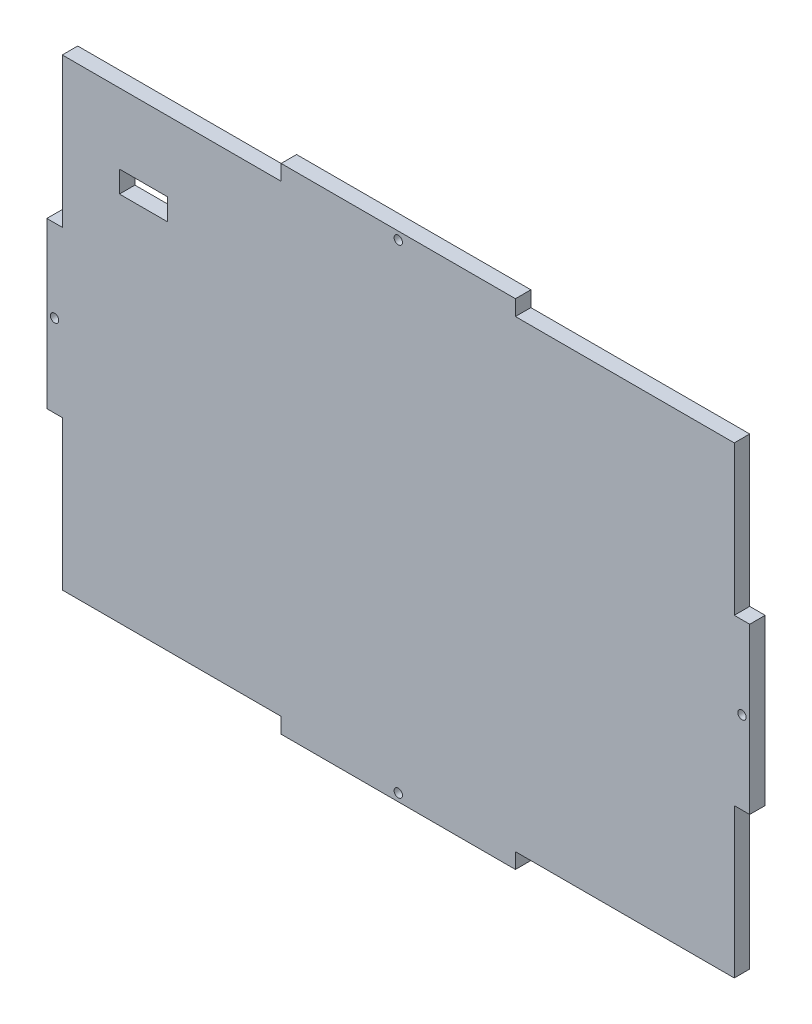
ISO-10303-21;
HEADER;
FILE_DESCRIPTION(('STEP AP214'),'2;1');
FILE_NAME('part.step','',(''),(''),'','','');
FILE_SCHEMA(('AUTOMOTIVE_DESIGN { 1 0 10303 214 1 1 1 1 }'));
ENDSEC;
DATA;
#1=APPLICATION_CONTEXT('core data for automotive mechanical design processes');
#2=APPLICATION_PROTOCOL_DEFINITION('international standard','automotive_design',2000,#1);
#3=PRODUCT_CONTEXT('',#1,'mechanical');
#4=PRODUCT('Part','Part','',(#3));
#5=PRODUCT_RELATED_PRODUCT_CATEGORY('part','',(#4));
#6=PRODUCT_DEFINITION_FORMATION('','',#4);
#7=PRODUCT_DEFINITION_CONTEXT('part definition',#1,'design');
#8=PRODUCT_DEFINITION('design','',#6,#7);
#9=PRODUCT_DEFINITION_SHAPE('','',#8);
#10=(LENGTH_UNIT() NAMED_UNIT(*) SI_UNIT(.MILLI.,.METRE.));
#11=(NAMED_UNIT(*) PLANE_ANGLE_UNIT() SI_UNIT($,.RADIAN.));
#12=(NAMED_UNIT(*) SI_UNIT($,.STERADIAN.) SOLID_ANGLE_UNIT());
#13=UNCERTAINTY_MEASURE_WITH_UNIT(LENGTH_MEASURE(1.E-05),#10,'distance_accuracy_value','');
#14=(GEOMETRIC_REPRESENTATION_CONTEXT(3) GLOBAL_UNCERTAINTY_ASSIGNED_CONTEXT((#13)) GLOBAL_UNIT_ASSIGNED_CONTEXT((#10,
#11,#12)) REPRESENTATION_CONTEXT('',''));
#15=CARTESIAN_POINT('',(0.,0.,0.));
#16=DIRECTION('',(0.,0.,1.));
#17=DIRECTION('',(1.,0.,0.));
#18=AXIS2_PLACEMENT_3D('',#15,#16,#17);
#19=CARTESIAN_POINT('',(115.57,-81.28,5.08));
#20=DIRECTION('',(-1.,0.,0.));
#21=DIRECTION('',(0.,0.,1.));
#22=AXIS2_PLACEMENT_3D('',#19,#20,#21);
#23=PLANE('',#22);
#24=DIRECTION('',(0.,0.,1.));
#25=VECTOR('',#24,1.);
#26=CARTESIAN_POINT('',(115.57,27.0933333333333,0.));
#27=LINE('',#26,#25);
#28=CARTESIAN_POINT('',(115.57,27.0933333333333,0.));
#29=VERTEX_POINT('',#28);
#30=CARTESIAN_POINT('',(115.57,27.0933333333333,5.07999999999999));
#31=VERTEX_POINT('',#30);
#32=EDGE_CURVE('E313',#29,#31,#27,.T.);
#33=ORIENTED_EDGE('',*,*,#32,.T.);
#34=DIRECTION('',(0.,1.,0.));
#35=VECTOR('',#34,1.);
#36=CARTESIAN_POINT('',(115.57,-81.28,5.08));
#37=LINE('',#36,#35);
#38=CARTESIAN_POINT('',(115.57,-27.0933333333333,5.07999999999999));
#39=VERTEX_POINT('',#38);
#40=EDGE_CURVE('E382',#39,#31,#37,.T.);
#41=ORIENTED_EDGE('',*,*,#40,.F.);
#42=DIRECTION('',(0.,0.,-1.));
#43=VECTOR('',#42,1.);
#44=CARTESIAN_POINT('',(115.57,-27.0933333333333,0.));
#45=LINE('',#44,#43);
#46=CARTESIAN_POINT('',(115.57,-27.0933333333333,0.));
#47=VERTEX_POINT('',#46);
#48=EDGE_CURVE('E318',#39,#47,#45,.T.);
#49=ORIENTED_EDGE('',*,*,#48,.T.);
#50=DIRECTION('',(0.,1.,0.));
#51=VECTOR('',#50,1.);
#52=CARTESIAN_POINT('',(115.57,-81.28,0.));
#53=LINE('',#52,#51);
#54=EDGE_CURVE('E379',#47,#29,#53,.T.);
#55=ORIENTED_EDGE('',*,*,#54,.T.);
#56=EDGE_LOOP('',(#33,#41,#49,#55));
#57=FACE_BOUND('',#56,.T.);
#58=ADVANCED_FACE('F33',(#57),#23,.F.);
#59=CARTESIAN_POINT('',(-115.57,81.28,5.08));
#60=DIRECTION('',(0.,-1.,0.));
#61=DIRECTION('',(0.,0.,-1.));
#62=AXIS2_PLACEMENT_3D('',#59,#60,#61);
#63=PLANE('',#62);
#64=DIRECTION('',(0.,0.,1.));
#65=VECTOR('',#64,1.);
#66=CARTESIAN_POINT('',(-38.5233333333334,81.28,0.));
#67=LINE('',#66,#65);
#68=CARTESIAN_POINT('',(-38.5233333333334,81.28,0.));
#69=VERTEX_POINT('',#68);
#70=CARTESIAN_POINT('',(-38.5233333333334,81.28,5.07999999999998));
#71=VERTEX_POINT('',#70);
#72=EDGE_CURVE('E258',#69,#71,#67,.T.);
#73=ORIENTED_EDGE('',*,*,#72,.T.);
#74=DIRECTION('',(-1.,0.,0.));
#75=VECTOR('',#74,1.);
#76=CARTESIAN_POINT('',(-115.57,81.28,5.08));
#77=LINE('',#76,#75);
#78=CARTESIAN_POINT('',(38.5233333333333,81.28,5.07999999999998));
#79=VERTEX_POINT('',#78);
#80=EDGE_CURVE('E384',#79,#71,#77,.T.);
#81=ORIENTED_EDGE('',*,*,#80,.F.);
#82=DIRECTION('',(0.,0.,-1.));
#83=VECTOR('',#82,1.);
#84=CARTESIAN_POINT('',(38.5233333333333,81.28,0.));
#85=LINE('',#84,#83);
#86=CARTESIAN_POINT('',(38.5233333333333,81.28,0.));
#87=VERTEX_POINT('',#86);
#88=EDGE_CURVE('E263',#79,#87,#85,.T.);
#89=ORIENTED_EDGE('',*,*,#88,.T.);
#90=DIRECTION('',(-1.,0.,0.));
#91=VECTOR('',#90,1.);
#92=CARTESIAN_POINT('',(-115.57,81.28,0.));
#93=LINE('',#92,#91);
#94=EDGE_CURVE('E389',#87,#69,#93,.T.);
#95=ORIENTED_EDGE('',*,*,#94,.T.);
#96=EDGE_LOOP('',(#73,#81,#89,#95));
#97=FACE_BOUND('',#96,.T.);
#98=ADVANCED_FACE('F455',(#97),#63,.F.);
#99=CARTESIAN_POINT('',(-115.57,-81.28,5.08));
#100=DIRECTION('',(1.,0.,0.));
#101=DIRECTION('',(0.,0.,-1.));
#102=AXIS2_PLACEMENT_3D('',#99,#100,#101);
#103=PLANE('',#102);
#104=DIRECTION('',(0.,0.,1.));
#105=VECTOR('',#104,1.);
#106=CARTESIAN_POINT('',(-115.57,-27.0933333333333,0.));
#107=LINE('',#106,#105);
#108=CARTESIAN_POINT('',(-115.57,-27.0933333333333,0.));
#109=VERTEX_POINT('',#108);
#110=CARTESIAN_POINT('',(-115.57,-27.0933333333333,5.07999999999999));
#111=VERTEX_POINT('',#110);
#112=EDGE_CURVE('E227',#109,#111,#107,.T.);
#113=ORIENTED_EDGE('',*,*,#112,.T.);
#114=DIRECTION('',(0.,-1.,0.));
#115=VECTOR('',#114,1.);
#116=CARTESIAN_POINT('',(-115.57,-81.28,5.08));
#117=LINE('',#116,#115);
#118=CARTESIAN_POINT('',(-115.57,27.0933333333333,5.07999999999999));
#119=VERTEX_POINT('',#118);
#120=EDGE_CURVE('E41',#119,#111,#117,.T.);
#121=ORIENTED_EDGE('',*,*,#120,.F.);
#122=DIRECTION('',(0.,0.,-1.));
#123=VECTOR('',#122,1.);
#124=CARTESIAN_POINT('',(-115.57,27.0933333333333,0.));
#125=LINE('',#124,#123);
#126=CARTESIAN_POINT('',(-115.57,27.0933333333333,0.));
#127=VERTEX_POINT('',#126);
#128=EDGE_CURVE('E235',#119,#127,#125,.T.);
#129=ORIENTED_EDGE('',*,*,#128,.T.);
#130=DIRECTION('',(0.,-1.,0.));
#131=VECTOR('',#130,1.);
#132=CARTESIAN_POINT('',(-115.57,-81.28,0.));
#133=LINE('',#132,#131);
#134=EDGE_CURVE('E391',#127,#109,#133,.T.);
#135=ORIENTED_EDGE('',*,*,#134,.T.);
#136=EDGE_LOOP('',(#113,#121,#129,#135));
#137=FACE_BOUND('',#136,.T.);
#138=ADVANCED_FACE('F434',(#137),#103,.F.);
#139=CARTESIAN_POINT('',(-115.57,-81.28,5.08));
#140=DIRECTION('',(0.,1.,0.));
#141=DIRECTION('',(0.,0.,1.));
#142=AXIS2_PLACEMENT_3D('',#139,#140,#141);
#143=PLANE('',#142);
#144=DIRECTION('',(0.,0.,1.));
#145=VECTOR('',#144,1.);
#146=CARTESIAN_POINT('',(-38.5233333333334,-81.28,0.));
#147=LINE('',#146,#145);
#148=CARTESIAN_POINT('',(-38.5233333333334,-81.28,0.));
#149=VERTEX_POINT('',#148);
#150=CARTESIAN_POINT('',(-38.5233333333334,-81.28,5.07999999999998));
#151=VERTEX_POINT('',#150);
#152=EDGE_CURVE('E287',#149,#151,#147,.T.);
#153=ORIENTED_EDGE('',*,*,#152,.F.);
#154=DIRECTION('',(1.,0.,0.));
#155=VECTOR('',#154,1.);
#156=CARTESIAN_POINT('',(-115.57,-81.28,0.));
#157=LINE('',#156,#155);
#158=CARTESIAN_POINT('',(38.5233333333333,-81.28,0.));
#159=VERTEX_POINT('',#158);
#160=EDGE_CURVE('E36',#149,#159,#157,.T.);
#161=ORIENTED_EDGE('',*,*,#160,.T.);
#162=DIRECTION('',(0.,0.,-1.));
#163=VECTOR('',#162,1.);
#164=CARTESIAN_POINT('',(38.5233333333333,-81.28,0.));
#165=LINE('',#164,#163);
#166=CARTESIAN_POINT('',(38.5233333333333,-81.28,5.07999999999998));
#167=VERTEX_POINT('',#166);
#168=EDGE_CURVE('E289',#167,#159,#165,.T.);
#169=ORIENTED_EDGE('',*,*,#168,.F.);
#170=DIRECTION('',(1.,0.,0.));
#171=VECTOR('',#170,1.);
#172=CARTESIAN_POINT('',(-115.57,-81.28,5.08));
#173=LINE('',#172,#171);
#174=EDGE_CURVE('E11',#151,#167,#173,.T.);
#175=ORIENTED_EDGE('',*,*,#174,.F.);
#176=EDGE_LOOP('',(#153,#161,#169,#175));
#177=FACE_BOUND('',#176,.T.);
#178=ADVANCED_FACE('F400',(#177),#143,.F.);
#179=CARTESIAN_POINT('',(0.,0.,0.));
#180=DIRECTION('',(0.,0.,-1.));
#181=DIRECTION('',(-1.,0.,0.));
#182=AXIS2_PLACEMENT_3D('',#179,#180,#181);
#183=PLANE('',#182);
#184=DIRECTION('',(0.,-1.,0.));
#185=VECTOR('',#184,1.);
#186=CARTESIAN_POINT('',(-75.946,53.086,0.));
#187=LINE('',#186,#185);
#188=CARTESIAN_POINT('',(-75.946,53.086,0.));
#189=VERTEX_POINT('',#188);
#190=CARTESIAN_POINT('',(-75.946,45.974,0.));
#191=VERTEX_POINT('',#190);
#192=EDGE_CURVE('E49',#189,#191,#187,.T.);
#193=ORIENTED_EDGE('',*,*,#192,.F.);
#194=DIRECTION('',(1.,0.,0.));
#195=VECTOR('',#194,1.);
#196=CARTESIAN_POINT('',(-75.946,53.086,0.));
#197=LINE('',#196,#195);
#198=CARTESIAN_POINT('',(-91.694,53.086,0.));
#199=VERTEX_POINT('',#198);
#200=EDGE_CURVE('E212',#199,#189,#197,.T.);
#201=ORIENTED_EDGE('',*,*,#200,.F.);
#202=DIRECTION('',(0.,1.,0.));
#203=VECTOR('',#202,1.);
#204=CARTESIAN_POINT('',(-91.694,53.086,0.));
#205=LINE('',#204,#203);
#206=CARTESIAN_POINT('',(-91.694,45.974,0.));
#207=VERTEX_POINT('',#206);
#208=EDGE_CURVE('E215',#207,#199,#205,.T.);
#209=ORIENTED_EDGE('',*,*,#208,.F.);
#210=DIRECTION('',(-1.,0.,0.));
#211=VECTOR('',#210,1.);
#212=CARTESIAN_POINT('',(-75.946,45.974,0.));
#213=LINE('',#212,#211);
#214=EDGE_CURVE('E221',#191,#207,#213,.T.);
#215=ORIENTED_EDGE('',*,*,#214,.F.);
#216=EDGE_LOOP('',(#193,#201,#209,#215));
#217=FACE_BOUND('',#216,.T.);
#218=CARTESIAN_POINT('',(0.,-78.74,0.));
#219=DIRECTION('',(0.,0.,-1.));
#220=DIRECTION('',(-1.,0.,0.));
#221=AXIS2_PLACEMENT_3D('',#218,#219,#220);
#222=CIRCLE('',#221,1.37795);
#223=CARTESIAN_POINT('',(-1.37795000000001,-78.74,0.));
#224=VERTEX_POINT('',#223);
#225=EDGE_CURVE('E361',#224,#224,#222,.T.);
#226=ORIENTED_EDGE('',*,*,#225,.F.);
#227=EDGE_LOOP('',(#226));
#228=FACE_BOUND('',#227,.T.);
#229=CARTESIAN_POINT('',(-113.03,0.,0.));
#230=DIRECTION('',(0.,0.,-1.));
#231=DIRECTION('',(1.,0.,0.));
#232=AXIS2_PLACEMENT_3D('',#229,#230,#231);
#233=CIRCLE('',#232,1.37795);
#234=CARTESIAN_POINT('',(-111.65205,0.,0.));
#235=VERTEX_POINT('',#234);
#236=EDGE_CURVE('E360',#235,#235,#233,.T.);
#237=ORIENTED_EDGE('',*,*,#236,.F.);
#238=EDGE_LOOP('',(#237));
#239=FACE_BOUND('',#238,.T.);
#240=CARTESIAN_POINT('',(0.,78.74,0.));
#241=DIRECTION('',(0.,0.,-1.));
#242=DIRECTION('',(1.,0.,0.));
#243=AXIS2_PLACEMENT_3D('',#240,#241,#242);
#244=CIRCLE('',#243,1.37795);
#245=CARTESIAN_POINT('',(1.37794999999999,78.74,0.));
#246=VERTEX_POINT('',#245);
#247=EDGE_CURVE('E367',#246,#246,#244,.T.);
#248=ORIENTED_EDGE('',*,*,#247,.F.);
#249=EDGE_LOOP('',(#248));
#250=FACE_BOUND('',#249,.T.);
#251=CARTESIAN_POINT('',(113.03,0.,0.));
#252=DIRECTION('',(0.,0.,-1.));
#253=DIRECTION('',(-1.,0.,0.));
#254=AXIS2_PLACEMENT_3D('',#251,#252,#253);
#255=CIRCLE('',#254,1.37795);
#256=CARTESIAN_POINT('',(111.65205,0.,0.));
#257=VERTEX_POINT('',#256);
#258=EDGE_CURVE('E373',#257,#257,#255,.T.);
#259=ORIENTED_EDGE('',*,*,#258,.F.);
#260=EDGE_LOOP('',(#259));
#261=FACE_BOUND('',#260,.T.);
#262=ORIENTED_EDGE('',*,*,#54,.F.);
#263=DIRECTION('',(1.,0.,0.));
#264=VECTOR('',#263,1.);
#265=CARTESIAN_POINT('',(110.49,-27.0933333333333,0.));
#266=LINE('',#265,#264);
#267=CARTESIAN_POINT('',(110.49,-27.0933333333333,0.));
#268=VERTEX_POINT('',#267);
#269=EDGE_CURVE('E330',#268,#47,#266,.T.);
#270=ORIENTED_EDGE('',*,*,#269,.F.);
#271=DIRECTION('',(0.,1.,0.));
#272=VECTOR('',#271,1.);
#273=CARTESIAN_POINT('',(110.49,81.28,0.));
#274=LINE('',#273,#272);
#275=CARTESIAN_POINT('',(110.49,-76.2,0.));
#276=VERTEX_POINT('',#275);
#277=EDGE_CURVE('E337',#276,#268,#274,.T.);
#278=ORIENTED_EDGE('',*,*,#277,.F.);
#279=DIRECTION('',(-1.,0.,0.));
#280=VECTOR('',#279,1.);
#281=CARTESIAN_POINT('',(-115.57,-76.2,0.));
#282=LINE('',#281,#280);
#283=CARTESIAN_POINT('',(38.5233333333333,-76.2,0.));
#284=VERTEX_POINT('',#283);
#285=EDGE_CURVE('E307',#276,#284,#282,.T.);
#286=ORIENTED_EDGE('',*,*,#285,.T.);
#287=DIRECTION('',(0.,1.,0.));
#288=VECTOR('',#287,1.);
#289=CARTESIAN_POINT('',(38.5233333333333,-81.28,0.));
#290=LINE('',#289,#288);
#291=EDGE_CURVE('E300',#159,#284,#290,.T.);
#292=ORIENTED_EDGE('',*,*,#291,.F.);
#293=ORIENTED_EDGE('',*,*,#160,.F.);
#294=DIRECTION('',(0.,1.,0.));
#295=VECTOR('',#294,1.);
#296=CARTESIAN_POINT('',(-38.5233333333334,-81.28,0.));
#297=LINE('',#296,#295);
#298=CARTESIAN_POINT('',(-38.5233333333334,-76.2,0.));
#299=VERTEX_POINT('',#298);
#300=EDGE_CURVE('E296',#149,#299,#297,.T.);
#301=ORIENTED_EDGE('',*,*,#300,.T.);
#302=CARTESIAN_POINT('',(-110.49,-76.2,0.));
#303=VERTEX_POINT('',#302);
#304=EDGE_CURVE('E299',#299,#303,#282,.T.);
#305=ORIENTED_EDGE('',*,*,#304,.T.);
#306=DIRECTION('',(0.,-1.,0.));
#307=VECTOR('',#306,1.);
#308=CARTESIAN_POINT('',(-110.49,-81.28,0.));
#309=LINE('',#308,#307);
#310=CARTESIAN_POINT('',(-110.49,-27.0933333333333,0.));
#311=VERTEX_POINT('',#310);
#312=EDGE_CURVE('E245',#311,#303,#309,.T.);
#313=ORIENTED_EDGE('',*,*,#312,.F.);
#314=DIRECTION('',(-1.,0.,0.));
#315=VECTOR('',#314,1.);
#316=CARTESIAN_POINT('',(-110.49,-27.0933333333333,0.));
#317=LINE('',#316,#315);
#318=EDGE_CURVE('E242',#311,#109,#317,.T.);
#319=ORIENTED_EDGE('',*,*,#318,.T.);
#320=ORIENTED_EDGE('',*,*,#134,.F.);
#321=DIRECTION('',(-1.,0.,0.));
#322=VECTOR('',#321,1.);
#323=CARTESIAN_POINT('',(-110.49,27.0933333333333,0.));
#324=LINE('',#323,#322);
#325=CARTESIAN_POINT('',(-110.49,27.0933333333333,0.));
#326=VERTEX_POINT('',#325);
#327=EDGE_CURVE('E246',#326,#127,#324,.T.);
#328=ORIENTED_EDGE('',*,*,#327,.F.);
#329=CARTESIAN_POINT('',(-110.49,76.2,0.));
#330=VERTEX_POINT('',#329);
#331=EDGE_CURVE('E253',#330,#326,#309,.T.);
#332=ORIENTED_EDGE('',*,*,#331,.F.);
#333=DIRECTION('',(-1.,0.,0.));
#334=VECTOR('',#333,1.);
#335=CARTESIAN_POINT('',(-115.57,76.2,0.));
#336=LINE('',#335,#334);
#337=CARTESIAN_POINT('',(-38.5233333333334,76.2,0.));
#338=VERTEX_POINT('',#337);
#339=EDGE_CURVE('E273',#338,#330,#336,.T.);
#340=ORIENTED_EDGE('',*,*,#339,.F.);
#341=DIRECTION('',(0.,1.,0.));
#342=VECTOR('',#341,1.);
#343=CARTESIAN_POINT('',(-38.5233333333334,76.2,0.));
#344=LINE('',#343,#342);
#345=EDGE_CURVE('E270',#338,#69,#344,.T.);
#346=ORIENTED_EDGE('',*,*,#345,.T.);
#347=ORIENTED_EDGE('',*,*,#94,.F.);
#348=DIRECTION('',(0.,1.,0.));
#349=VECTOR('',#348,1.);
#350=CARTESIAN_POINT('',(38.5233333333333,76.2,0.));
#351=LINE('',#350,#349);
#352=CARTESIAN_POINT('',(38.5233333333333,76.2,0.));
#353=VERTEX_POINT('',#352);
#354=EDGE_CURVE('E274',#353,#87,#351,.T.);
#355=ORIENTED_EDGE('',*,*,#354,.F.);
#356=CARTESIAN_POINT('',(110.49,76.2,0.));
#357=VERTEX_POINT('',#356);
#358=EDGE_CURVE('E281',#357,#353,#336,.T.);
#359=ORIENTED_EDGE('',*,*,#358,.F.);
#360=CARTESIAN_POINT('',(110.49,27.0933333333333,0.));
#361=VERTEX_POINT('',#360);
#362=EDGE_CURVE('E329',#361,#357,#274,.T.);
#363=ORIENTED_EDGE('',*,*,#362,.F.);
#364=DIRECTION('',(1.,0.,0.));
#365=VECTOR('',#364,1.);
#366=CARTESIAN_POINT('',(110.49,27.0933333333333,0.));
#367=LINE('',#366,#365);
#368=EDGE_CURVE('E326',#361,#29,#367,.T.);
#369=ORIENTED_EDGE('',*,*,#368,.T.);
#370=EDGE_LOOP('',(#262,#270,#278,#286,#292,#293,#301,#305,#313,#319,#320,#328,#332,#340,#346,
#347,#355,#359,#363,#369));
#371=FACE_BOUND('',#370,.T.);
#372=ADVANCED_FACE('F405',(#217,#228,#239,#250,#261,#371),#183,.T.);
#373=CARTESIAN_POINT('',(0.,0.,5.08));
#374=DIRECTION('',(0.,0.,-1.));
#375=DIRECTION('',(-1.,0.,0.));
#376=AXIS2_PLACEMENT_3D('',#373,#374,#375);
#377=PLANE('',#376);
#378=DIRECTION('',(1.,0.,0.));
#379=VECTOR('',#378,1.);
#380=CARTESIAN_POINT('',(-75.946,53.086,5.08000000000001));
#381=LINE('',#380,#379);
#382=CARTESIAN_POINT('',(-91.694,53.086,5.08000000000001));
#383=VERTEX_POINT('',#382);
#384=CARTESIAN_POINT('',(-75.946,53.086,5.08000000000001));
#385=VERTEX_POINT('',#384);
#386=EDGE_CURVE('E202',#383,#385,#381,.T.);
#387=ORIENTED_EDGE('',*,*,#386,.T.);
#388=DIRECTION('',(0.,-1.,0.));
#389=VECTOR('',#388,1.);
#390=CARTESIAN_POINT('',(-75.946,53.086,5.08000000000001));
#391=LINE('',#390,#389);
#392=CARTESIAN_POINT('',(-75.946,45.974,5.08000000000001));
#393=VERTEX_POINT('',#392);
#394=EDGE_CURVE('E196',#385,#393,#391,.T.);
#395=ORIENTED_EDGE('',*,*,#394,.T.);
#396=DIRECTION('',(-1.,0.,0.));
#397=VECTOR('',#396,1.);
#398=CARTESIAN_POINT('',(-75.946,45.974,5.08000000000001));
#399=LINE('',#398,#397);
#400=CARTESIAN_POINT('',(-91.694,45.974,5.08));
#401=VERTEX_POINT('',#400);
#402=EDGE_CURVE('E205',#393,#401,#399,.T.);
#403=ORIENTED_EDGE('',*,*,#402,.T.);
#404=DIRECTION('',(0.,1.,0.));
#405=VECTOR('',#404,1.);
#406=CARTESIAN_POINT('',(-91.694,53.086,5.08000000000001));
#407=LINE('',#406,#405);
#408=EDGE_CURVE('E57',#401,#383,#407,.T.);
#409=ORIENTED_EDGE('',*,*,#408,.T.);
#410=EDGE_LOOP('',(#387,#395,#403,#409));
#411=FACE_BOUND('',#410,.T.);
#412=DIRECTION('',(1.,0.,0.));
#413=VECTOR('',#412,1.);
#414=CARTESIAN_POINT('',(110.49,27.0933333333333,5.07999999999999));
#415=LINE('',#414,#413);
#416=CARTESIAN_POINT('',(110.49,27.0933333333333,5.07999999999999));
#417=VERTEX_POINT('',#416);
#418=EDGE_CURVE('E321',#417,#31,#415,.T.);
#419=ORIENTED_EDGE('',*,*,#418,.F.);
#420=DIRECTION('',(0.,1.,0.));
#421=VECTOR('',#420,1.);
#422=CARTESIAN_POINT('',(110.49,0.,5.08));
#423=LINE('',#422,#421);
#424=CARTESIAN_POINT('',(110.49,76.2,5.08));
#425=VERTEX_POINT('',#424);
#426=EDGE_CURVE('E353',#417,#425,#423,.T.);
#427=ORIENTED_EDGE('',*,*,#426,.T.);
#428=DIRECTION('',(-1.,0.,0.));
#429=VECTOR('',#428,1.);
#430=CARTESIAN_POINT('',(0.,76.2,5.08));
#431=LINE('',#430,#429);
#432=CARTESIAN_POINT('',(38.5233333333333,76.2,5.07999999999998));
#433=VERTEX_POINT('',#432);
#434=EDGE_CURVE('E345',#425,#433,#431,.T.);
#435=ORIENTED_EDGE('',*,*,#434,.T.);
#436=DIRECTION('',(0.,1.,0.));
#437=VECTOR('',#436,1.);
#438=CARTESIAN_POINT('',(38.5233333333333,76.2,5.07999999999998));
#439=LINE('',#438,#437);
#440=EDGE_CURVE('E276',#433,#79,#439,.T.);
#441=ORIENTED_EDGE('',*,*,#440,.T.);
#442=ORIENTED_EDGE('',*,*,#80,.T.);
#443=DIRECTION('',(0.,1.,0.));
#444=VECTOR('',#443,1.);
#445=CARTESIAN_POINT('',(-38.5233333333334,76.2,5.07999999999998));
#446=LINE('',#445,#444);
#447=CARTESIAN_POINT('',(-38.5233333333334,76.2,5.07999999999998));
#448=VERTEX_POINT('',#447);
#449=EDGE_CURVE('E265',#448,#71,#446,.T.);
#450=ORIENTED_EDGE('',*,*,#449,.F.);
#451=CARTESIAN_POINT('',(-110.49,76.2,5.08000000000001));
#452=VERTEX_POINT('',#451);
#453=EDGE_CURVE('E342',#448,#452,#431,.T.);
#454=ORIENTED_EDGE('',*,*,#453,.T.);
#455=DIRECTION('',(0.,-1.,0.));
#456=VECTOR('',#455,1.);
#457=CARTESIAN_POINT('',(-110.49,0.,5.08));
#458=LINE('',#457,#456);
#459=CARTESIAN_POINT('',(-110.49,27.0933333333333,5.07999999999999));
#460=VERTEX_POINT('',#459);
#461=EDGE_CURVE('E349',#452,#460,#458,.T.);
#462=ORIENTED_EDGE('',*,*,#461,.T.);
#463=DIRECTION('',(-1.,0.,0.));
#464=VECTOR('',#463,1.);
#465=CARTESIAN_POINT('',(-110.49,27.0933333333333,5.07999999999999));
#466=LINE('',#465,#464);
#467=EDGE_CURVE('E248',#460,#119,#466,.T.);
#468=ORIENTED_EDGE('',*,*,#467,.T.);
#469=ORIENTED_EDGE('',*,*,#120,.T.);
#470=DIRECTION('',(-1.,0.,0.));
#471=VECTOR('',#470,1.);
#472=CARTESIAN_POINT('',(-110.49,-27.0933333333333,5.07999999999999));
#473=LINE('',#472,#471);
#474=CARTESIAN_POINT('',(-110.49,-27.0933333333333,5.07999999999999));
#475=VERTEX_POINT('',#474);
#476=EDGE_CURVE('E237',#475,#111,#473,.T.);
#477=ORIENTED_EDGE('',*,*,#476,.F.);
#478=CARTESIAN_POINT('',(-110.49,-76.2,5.08000000000001));
#479=VERTEX_POINT('',#478);
#480=EDGE_CURVE('E346',#475,#479,#458,.T.);
#481=ORIENTED_EDGE('',*,*,#480,.T.);
#482=DIRECTION('',(-1.,0.,0.));
#483=VECTOR('',#482,1.);
#484=CARTESIAN_POINT('',(0.,-76.2,5.08));
#485=LINE('',#484,#483);
#486=CARTESIAN_POINT('',(-38.5233333333334,-76.2,5.07999999999998));
#487=VERTEX_POINT('',#486);
#488=EDGE_CURVE('E350',#487,#479,#485,.T.);
#489=ORIENTED_EDGE('',*,*,#488,.F.);
#490=DIRECTION('',(0.,1.,0.));
#491=VECTOR('',#490,1.);
#492=CARTESIAN_POINT('',(-38.5233333333334,-81.28,5.07999999999998));
#493=LINE('',#492,#491);
#494=EDGE_CURVE('E292',#151,#487,#493,.T.);
#495=ORIENTED_EDGE('',*,*,#494,.F.);
#496=ORIENTED_EDGE('',*,*,#174,.T.);
#497=DIRECTION('',(0.,1.,0.));
#498=VECTOR('',#497,1.);
#499=CARTESIAN_POINT('',(38.5233333333333,-81.28,5.07999999999998));
#500=LINE('',#499,#498);
#501=CARTESIAN_POINT('',(38.5233333333333,-76.2,5.07999999999998));
#502=VERTEX_POINT('',#501);
#503=EDGE_CURVE('E303',#167,#502,#500,.T.);
#504=ORIENTED_EDGE('',*,*,#503,.T.);
#505=CARTESIAN_POINT('',(110.49,-76.2,5.08));
#506=VERTEX_POINT('',#505);
#507=EDGE_CURVE('E352',#506,#502,#485,.T.);
#508=ORIENTED_EDGE('',*,*,#507,.F.);
#509=CARTESIAN_POINT('',(110.49,-27.0933333333333,5.07999999999999));
#510=VERTEX_POINT('',#509);
#511=EDGE_CURVE('E356',#506,#510,#423,.T.);
#512=ORIENTED_EDGE('',*,*,#511,.T.);
#513=DIRECTION('',(1.,0.,0.));
#514=VECTOR('',#513,1.);
#515=CARTESIAN_POINT('',(110.49,-27.0933333333333,5.07999999999999));
#516=LINE('',#515,#514);
#517=EDGE_CURVE('E332',#510,#39,#516,.T.);
#518=ORIENTED_EDGE('',*,*,#517,.T.);
#519=ORIENTED_EDGE('',*,*,#40,.T.);
#520=EDGE_LOOP('',(#419,#427,#435,#441,#442,#450,#454,#462,#468,#469,#477,#481,#489,#495,#496,
#504,#508,#512,#518,#519));
#521=FACE_BOUND('',#520,.T.);
#522=CARTESIAN_POINT('',(113.03,0.,5.08));
#523=DIRECTION('',(0.,0.,-1.));
#524=DIRECTION('',(-1.,0.,0.));
#525=AXIS2_PLACEMENT_3D('',#522,#523,#524);
#526=CIRCLE('',#525,1.37795);
#527=CARTESIAN_POINT('',(111.65205,0.,5.08));
#528=VERTEX_POINT('',#527);
#529=EDGE_CURVE('E376',#528,#528,#526,.T.);
#530=ORIENTED_EDGE('',*,*,#529,.T.);
#531=EDGE_LOOP('',(#530));
#532=FACE_BOUND('',#531,.T.);
#533=CARTESIAN_POINT('',(0.,-78.74,5.08));
#534=DIRECTION('',(0.,0.,-1.));
#535=DIRECTION('',(-1.,0.,0.));
#536=AXIS2_PLACEMENT_3D('',#533,#534,#535);
#537=CIRCLE('',#536,1.37795);
#538=CARTESIAN_POINT('',(-1.37795000000001,-78.74,5.08));
#539=VERTEX_POINT('',#538);
#540=EDGE_CURVE('E357',#539,#539,#537,.T.);
#541=ORIENTED_EDGE('',*,*,#540,.T.);
#542=EDGE_LOOP('',(#541));
#543=FACE_BOUND('',#542,.T.);
#544=CARTESIAN_POINT('',(0.,78.74,5.08));
#545=DIRECTION('',(0.,0.,-1.));
#546=DIRECTION('',(1.,0.,0.));
#547=AXIS2_PLACEMENT_3D('',#544,#545,#546);
#548=CIRCLE('',#547,1.37795);
#549=CARTESIAN_POINT('',(1.37794999999999,78.74,5.08));
#550=VERTEX_POINT('',#549);
#551=EDGE_CURVE('E370',#550,#550,#548,.T.);
#552=ORIENTED_EDGE('',*,*,#551,.T.);
#553=EDGE_LOOP('',(#552));
#554=FACE_BOUND('',#553,.T.);
#555=CARTESIAN_POINT('',(-113.03,0.,5.08));
#556=DIRECTION('',(0.,0.,-1.));
#557=DIRECTION('',(1.,0.,0.));
#558=AXIS2_PLACEMENT_3D('',#555,#556,#557);
#559=CIRCLE('',#558,1.37795);
#560=CARTESIAN_POINT('',(-111.65205,0.,5.08));
#561=VERTEX_POINT('',#560);
#562=EDGE_CURVE('E364',#561,#561,#559,.T.);
#563=ORIENTED_EDGE('',*,*,#562,.T.);
#564=EDGE_LOOP('',(#563));
#565=FACE_BOUND('',#564,.T.);
#566=ADVANCED_FACE('F209',(#411,#521,#532,#543,#554,#565),#377,.F.);
#567=CARTESIAN_POINT('',(113.03,0.,5.08));
#568=DIRECTION('',(0.,0.,-1.));
#569=DIRECTION('',(-1.,0.,0.));
#570=AXIS2_PLACEMENT_3D('',#567,#568,#569);
#571=CYLINDRICAL_SURFACE('',#570,1.37795);
#572=ORIENTED_EDGE('',*,*,#529,.F.);
#573=EDGE_LOOP('',(#572));
#574=FACE_BOUND('',#573,.T.);
#575=ORIENTED_EDGE('',*,*,#258,.T.);
#576=EDGE_LOOP('',(#575));
#577=FACE_BOUND('',#576,.T.);
#578=ADVANCED_FACE('F506',(#574,#577),#571,.F.);
#579=CARTESIAN_POINT('',(0.,78.74,5.08));
#580=DIRECTION('',(0.,0.,-1.));
#581=DIRECTION('',(-1.,0.,0.));
#582=AXIS2_PLACEMENT_3D('',#579,#580,#581);
#583=CYLINDRICAL_SURFACE('',#582,1.37795);
#584=ORIENTED_EDGE('',*,*,#551,.F.);
#585=EDGE_LOOP('',(#584));
#586=FACE_BOUND('',#585,.T.);
#587=ORIENTED_EDGE('',*,*,#247,.T.);
#588=EDGE_LOOP('',(#587));
#589=FACE_BOUND('',#588,.T.);
#590=ADVANCED_FACE('F509',(#586,#589),#583,.F.);
#591=CARTESIAN_POINT('',(-113.03,0.,5.08));
#592=DIRECTION('',(0.,0.,-1.));
#593=DIRECTION('',(-1.,0.,0.));
#594=AXIS2_PLACEMENT_3D('',#591,#592,#593);
#595=CYLINDRICAL_SURFACE('',#594,1.37795);
#596=ORIENTED_EDGE('',*,*,#562,.F.);
#597=EDGE_LOOP('',(#596));
#598=FACE_BOUND('',#597,.T.);
#599=ORIENTED_EDGE('',*,*,#236,.T.);
#600=EDGE_LOOP('',(#599));
#601=FACE_BOUND('',#600,.T.);
#602=ADVANCED_FACE('F513',(#598,#601),#595,.F.);
#603=CARTESIAN_POINT('',(0.,-78.74,5.08));
#604=DIRECTION('',(0.,0.,-1.));
#605=DIRECTION('',(-1.,0.,0.));
#606=AXIS2_PLACEMENT_3D('',#603,#604,#605);
#607=CYLINDRICAL_SURFACE('',#606,1.37795);
#608=ORIENTED_EDGE('',*,*,#540,.F.);
#609=EDGE_LOOP('',(#608));
#610=FACE_BOUND('',#609,.T.);
#611=ORIENTED_EDGE('',*,*,#225,.T.);
#612=EDGE_LOOP('',(#611));
#613=FACE_BOUND('',#612,.T.);
#614=ADVANCED_FACE('F517',(#610,#613),#607,.F.);
#615=CARTESIAN_POINT('',(-110.49,27.0933333333333,0.));
#616=DIRECTION('',(0.,1.,0.));
#617=DIRECTION('',(1.,0.,0.));
#618=AXIS2_PLACEMENT_3D('',#615,#616,#617);
#619=PLANE('',#618);
#620=ORIENTED_EDGE('',*,*,#128,.F.);
#621=ORIENTED_EDGE('',*,*,#467,.F.);
#622=DIRECTION('',(0.,0.,-1.));
#623=VECTOR('',#622,1.);
#624=CARTESIAN_POINT('',(-110.49,27.0933333333333,0.));
#625=LINE('',#624,#623);
#626=EDGE_CURVE('E234',#460,#326,#625,.T.);
#627=ORIENTED_EDGE('',*,*,#626,.T.);
#628=ORIENTED_EDGE('',*,*,#327,.T.);
#629=EDGE_LOOP('',(#620,#621,#627,#628));
#630=FACE_BOUND('',#629,.T.);
#631=ADVANCED_FACE('F438',(#630),#619,.T.);
#632=CARTESIAN_POINT('',(-38.5233333333334,76.2,0.));
#633=DIRECTION('',(-1.,0.,0.));
#634=DIRECTION('',(0.,1.,0.));
#635=AXIS2_PLACEMENT_3D('',#632,#633,#634);
#636=PLANE('',#635);
#637=ORIENTED_EDGE('',*,*,#72,.F.);
#638=ORIENTED_EDGE('',*,*,#345,.F.);
#639=DIRECTION('',(0.,0.,1.));
#640=VECTOR('',#639,1.);
#641=CARTESIAN_POINT('',(-38.5233333333334,76.2,0.));
#642=LINE('',#641,#640);
#643=EDGE_CURVE('E259',#338,#448,#642,.T.);
#644=ORIENTED_EDGE('',*,*,#643,.T.);
#645=ORIENTED_EDGE('',*,*,#449,.T.);
#646=EDGE_LOOP('',(#637,#638,#644,#645));
#647=FACE_BOUND('',#646,.T.);
#648=ADVANCED_FACE('F451',(#647),#636,.T.);
#649=CARTESIAN_POINT('',(0.,76.2,36.83));
#650=DIRECTION('',(0.,-1.,0.));
#651=DIRECTION('',(-1.,0.,0.));
#652=AXIS2_PLACEMENT_3D('',#649,#650,#651);
#653=PLANE('',#652);
#654=ORIENTED_EDGE('',*,*,#643,.F.);
#655=ORIENTED_EDGE('',*,*,#339,.T.);
#656=DIRECTION('',(0.,0.,-1.));
#657=VECTOR('',#656,1.);
#658=CARTESIAN_POINT('',(-110.49,76.2,24.5533333333333));
#659=LINE('',#658,#657);
#660=EDGE_CURVE('E256',#452,#330,#659,.T.);
#661=ORIENTED_EDGE('',*,*,#660,.F.);
#662=ORIENTED_EDGE('',*,*,#453,.F.);
#663=EDGE_LOOP('',(#654,#655,#661,#662));
#664=FACE_BOUND('',#663,.T.);
#665=ADVANCED_FACE('F447',(#664),#653,.F.);
#666=CARTESIAN_POINT('',(-110.49,0.,36.83));
#667=DIRECTION('',(1.,0.,0.));
#668=DIRECTION('',(0.,-1.,0.));
#669=AXIS2_PLACEMENT_3D('',#666,#667,#668);
#670=PLANE('',#669);
#671=ORIENTED_EDGE('',*,*,#660,.T.);
#672=ORIENTED_EDGE('',*,*,#331,.T.);
#673=ORIENTED_EDGE('',*,*,#626,.F.);
#674=ORIENTED_EDGE('',*,*,#461,.F.);
#675=EDGE_LOOP('',(#671,#672,#673,#674));
#676=FACE_BOUND('',#675,.T.);
#677=ADVANCED_FACE('F444',(#676),#670,.F.);
#678=CARTESIAN_POINT('',(-110.49,-27.0933333333333,0.));
#679=DIRECTION('',(0.,-1.,0.));
#680=DIRECTION('',(-1.,0.,0.));
#681=AXIS2_PLACEMENT_3D('',#678,#679,#680);
#682=PLANE('',#681);
#683=ORIENTED_EDGE('',*,*,#112,.F.);
#684=ORIENTED_EDGE('',*,*,#318,.F.);
#685=DIRECTION('',(0.,0.,1.));
#686=VECTOR('',#685,1.);
#687=CARTESIAN_POINT('',(-110.49,-27.0933333333333,0.));
#688=LINE('',#687,#686);
#689=EDGE_CURVE('E231',#311,#475,#688,.T.);
#690=ORIENTED_EDGE('',*,*,#689,.T.);
#691=ORIENTED_EDGE('',*,*,#476,.T.);
#692=EDGE_LOOP('',(#683,#684,#690,#691));
#693=FACE_BOUND('',#692,.T.);
#694=ADVANCED_FACE('F432',(#693),#682,.T.);
#695=ORIENTED_EDGE('',*,*,#689,.F.);
#696=ORIENTED_EDGE('',*,*,#312,.T.);
#697=DIRECTION('',(0.,0.,-1.));
#698=VECTOR('',#697,1.);
#699=CARTESIAN_POINT('',(-110.49,-76.2,24.5533333333333));
#700=LINE('',#699,#698);
#701=EDGE_CURVE('E284',#479,#303,#700,.T.);
#702=ORIENTED_EDGE('',*,*,#701,.F.);
#703=ORIENTED_EDGE('',*,*,#480,.F.);
#704=EDGE_LOOP('',(#695,#696,#702,#703));
#705=FACE_BOUND('',#704,.T.);
#706=ADVANCED_FACE('F429',(#705),#670,.F.);
#707=CARTESIAN_POINT('',(-38.5233333333334,-81.28,0.));
#708=DIRECTION('',(-1.,0.,0.));
#709=DIRECTION('',(0.,1.,0.));
#710=AXIS2_PLACEMENT_3D('',#707,#708,#709);
#711=PLANE('',#710);
#712=DIRECTION('',(0.,0.,1.));
#713=VECTOR('',#712,1.);
#714=CARTESIAN_POINT('',(-38.5233333333334,-76.2,0.));
#715=LINE('',#714,#713);
#716=EDGE_CURVE('E286',#299,#487,#715,.T.);
#717=ORIENTED_EDGE('',*,*,#716,.F.);
#718=ORIENTED_EDGE('',*,*,#300,.F.);
#719=ORIENTED_EDGE('',*,*,#152,.T.);
#720=ORIENTED_EDGE('',*,*,#494,.T.);
#721=EDGE_LOOP('',(#717,#718,#719,#720));
#722=FACE_BOUND('',#721,.T.);
#723=ADVANCED_FACE('F420',(#722),#711,.T.);
#724=CARTESIAN_POINT('',(0.,-76.2,36.83));
#725=DIRECTION('',(0.,-1.,0.));
#726=DIRECTION('',(-1.,0.,0.));
#727=AXIS2_PLACEMENT_3D('',#724,#725,#726);
#728=PLANE('',#727);
#729=ORIENTED_EDGE('',*,*,#488,.T.);
#730=ORIENTED_EDGE('',*,*,#701,.T.);
#731=ORIENTED_EDGE('',*,*,#304,.F.);
#732=ORIENTED_EDGE('',*,*,#716,.T.);
#733=EDGE_LOOP('',(#729,#730,#731,#732));
#734=FACE_BOUND('',#733,.T.);
#735=ADVANCED_FACE('F423',(#734),#728,.T.);
#736=CARTESIAN_POINT('',(38.5233333333333,76.2,0.));
#737=DIRECTION('',(1.,0.,0.));
#738=DIRECTION('',(0.,-1.,0.));
#739=AXIS2_PLACEMENT_3D('',#736,#737,#738);
#740=PLANE('',#739);
#741=ORIENTED_EDGE('',*,*,#88,.F.);
#742=ORIENTED_EDGE('',*,*,#440,.F.);
#743=DIRECTION('',(0.,0.,-1.));
#744=VECTOR('',#743,1.);
#745=CARTESIAN_POINT('',(38.5233333333333,76.2,0.));
#746=LINE('',#745,#744);
#747=EDGE_CURVE('E262',#433,#353,#746,.T.);
#748=ORIENTED_EDGE('',*,*,#747,.T.);
#749=ORIENTED_EDGE('',*,*,#354,.T.);
#750=EDGE_LOOP('',(#741,#742,#748,#749));
#751=FACE_BOUND('',#750,.T.);
#752=ADVANCED_FACE('F459',(#751),#740,.T.);
#753=DIRECTION('',(0.,0.,1.));
#754=VECTOR('',#753,1.);
#755=CARTESIAN_POINT('',(110.49,76.2,36.83));
#756=LINE('',#755,#754);
#757=EDGE_CURVE('E310',#357,#425,#756,.T.);
#758=ORIENTED_EDGE('',*,*,#757,.F.);
#759=ORIENTED_EDGE('',*,*,#358,.T.);
#760=ORIENTED_EDGE('',*,*,#747,.F.);
#761=ORIENTED_EDGE('',*,*,#434,.F.);
#762=EDGE_LOOP('',(#758,#759,#760,#761));
#763=FACE_BOUND('',#762,.T.);
#764=ADVANCED_FACE('F462',(#763),#653,.F.);
#765=CARTESIAN_POINT('',(110.49,27.0933333333333,0.));
#766=DIRECTION('',(0.,1.,0.));
#767=DIRECTION('',(1.,0.,0.));
#768=AXIS2_PLACEMENT_3D('',#765,#766,#767);
#769=PLANE('',#768);
#770=ORIENTED_EDGE('',*,*,#32,.F.);
#771=ORIENTED_EDGE('',*,*,#368,.F.);
#772=DIRECTION('',(0.,0.,1.));
#773=VECTOR('',#772,1.);
#774=CARTESIAN_POINT('',(110.49,27.0933333333333,0.));
#775=LINE('',#774,#773);
#776=EDGE_CURVE('E314',#361,#417,#775,.T.);
#777=ORIENTED_EDGE('',*,*,#776,.T.);
#778=ORIENTED_EDGE('',*,*,#418,.T.);
#779=EDGE_LOOP('',(#770,#771,#777,#778));
#780=FACE_BOUND('',#779,.T.);
#781=ADVANCED_FACE('F522',(#780),#769,.T.);
#782=CARTESIAN_POINT('',(110.49,0.,36.83));
#783=DIRECTION('',(-1.,0.,0.));
#784=DIRECTION('',(0.,1.,0.));
#785=AXIS2_PLACEMENT_3D('',#782,#783,#784);
#786=PLANE('',#785);
#787=ORIENTED_EDGE('',*,*,#776,.F.);
#788=ORIENTED_EDGE('',*,*,#362,.T.);
#789=ORIENTED_EDGE('',*,*,#757,.T.);
#790=ORIENTED_EDGE('',*,*,#426,.F.);
#791=EDGE_LOOP('',(#787,#788,#789,#790));
#792=FACE_BOUND('',#791,.T.);
#793=ADVANCED_FACE('F465',(#792),#786,.F.);
#794=DIRECTION('',(0.,0.,1.));
#795=VECTOR('',#794,1.);
#796=CARTESIAN_POINT('',(110.49,-76.2,36.83));
#797=LINE('',#796,#795);
#798=EDGE_CURVE('E339',#276,#506,#797,.T.);
#799=ORIENTED_EDGE('',*,*,#798,.F.);
#800=ORIENTED_EDGE('',*,*,#277,.T.);
#801=DIRECTION('',(0.,0.,-1.));
#802=VECTOR('',#801,1.);
#803=CARTESIAN_POINT('',(110.49,-27.0933333333333,0.));
#804=LINE('',#803,#802);
#805=EDGE_CURVE('E317',#510,#268,#804,.T.);
#806=ORIENTED_EDGE('',*,*,#805,.F.);
#807=ORIENTED_EDGE('',*,*,#511,.F.);
#808=EDGE_LOOP('',(#799,#800,#806,#807));
#809=FACE_BOUND('',#808,.T.);
#810=ADVANCED_FACE('F477',(#809),#786,.F.);
#811=ORIENTED_EDGE('',*,*,#507,.T.);
#812=DIRECTION('',(0.,0.,-1.));
#813=VECTOR('',#812,1.);
#814=CARTESIAN_POINT('',(38.5233333333333,-76.2,0.));
#815=LINE('',#814,#813);
#816=EDGE_CURVE('E290',#502,#284,#815,.T.);
#817=ORIENTED_EDGE('',*,*,#816,.T.);
#818=ORIENTED_EDGE('',*,*,#285,.F.);
#819=ORIENTED_EDGE('',*,*,#798,.T.);
#820=EDGE_LOOP('',(#811,#817,#818,#819));
#821=FACE_BOUND('',#820,.T.);
#822=ADVANCED_FACE('F479',(#821),#728,.T.);
#823=CARTESIAN_POINT('',(110.49,-27.0933333333333,0.));
#824=DIRECTION('',(0.,-1.,0.));
#825=DIRECTION('',(-1.,0.,0.));
#826=AXIS2_PLACEMENT_3D('',#823,#824,#825);
#827=PLANE('',#826);
#828=ORIENTED_EDGE('',*,*,#48,.F.);
#829=ORIENTED_EDGE('',*,*,#517,.F.);
#830=ORIENTED_EDGE('',*,*,#805,.T.);
#831=ORIENTED_EDGE('',*,*,#269,.T.);
#832=EDGE_LOOP('',(#828,#829,#830,#831));
#833=FACE_BOUND('',#832,.T.);
#834=ADVANCED_FACE('F475',(#833),#827,.T.);
#835=CARTESIAN_POINT('',(38.5233333333333,-81.28,0.));
#836=DIRECTION('',(1.,0.,0.));
#837=DIRECTION('',(0.,-1.,0.));
#838=AXIS2_PLACEMENT_3D('',#835,#836,#837);
#839=PLANE('',#838);
#840=ORIENTED_EDGE('',*,*,#816,.F.);
#841=ORIENTED_EDGE('',*,*,#503,.F.);
#842=ORIENTED_EDGE('',*,*,#168,.T.);
#843=ORIENTED_EDGE('',*,*,#291,.T.);
#844=EDGE_LOOP('',(#840,#841,#842,#843));
#845=FACE_BOUND('',#844,.T.);
#846=ADVANCED_FACE('F411',(#845),#839,.T.);
#847=CARTESIAN_POINT('',(-75.946,53.086,5.08000000000001));
#848=DIRECTION('',(1.,0.,0.));
#849=DIRECTION('',(0.,0.,-1.));
#850=AXIS2_PLACEMENT_3D('',#847,#848,#849);
#851=PLANE('',#850);
#852=ORIENTED_EDGE('',*,*,#192,.T.);
#853=DIRECTION('',(0.,0.,-1.));
#854=VECTOR('',#853,1.);
#855=CARTESIAN_POINT('',(-75.946,45.974,5.08000000000001));
#856=LINE('',#855,#854);
#857=EDGE_CURVE('E192',#393,#191,#856,.T.);
#858=ORIENTED_EDGE('',*,*,#857,.F.);
#859=ORIENTED_EDGE('',*,*,#394,.F.);
#860=DIRECTION('',(0.,0.,-1.));
#861=VECTOR('',#860,1.);
#862=CARTESIAN_POINT('',(-75.946,53.086,5.08000000000001));
#863=LINE('',#862,#861);
#864=EDGE_CURVE('E225',#385,#189,#863,.T.);
#865=ORIENTED_EDGE('',*,*,#864,.T.);
#866=EDGE_LOOP('',(#852,#858,#859,#865));
#867=FACE_BOUND('',#866,.T.);
#868=ADVANCED_FACE('F194',(#867),#851,.F.);
#869=CARTESIAN_POINT('',(-75.946,53.086,5.08000000000001));
#870=DIRECTION('',(0.,1.,0.));
#871=DIRECTION('',(0.,0.,1.));
#872=AXIS2_PLACEMENT_3D('',#869,#870,#871);
#873=PLANE('',#872);
#874=ORIENTED_EDGE('',*,*,#200,.T.);
#875=ORIENTED_EDGE('',*,*,#864,.F.);
#876=ORIENTED_EDGE('',*,*,#386,.F.);
#877=DIRECTION('',(0.,0.,-1.));
#878=VECTOR('',#877,1.);
#879=CARTESIAN_POINT('',(-91.694,53.086,5.08000000000001));
#880=LINE('',#879,#878);
#881=EDGE_CURVE('E228',#383,#199,#880,.T.);
#882=ORIENTED_EDGE('',*,*,#881,.T.);
#883=EDGE_LOOP('',(#874,#875,#876,#882));
#884=FACE_BOUND('',#883,.T.);
#885=ADVANCED_FACE('F550',(#884),#873,.F.);
#886=CARTESIAN_POINT('',(-91.694,53.086,5.08000000000001));
#887=DIRECTION('',(-1.,0.,0.));
#888=DIRECTION('',(0.,0.,1.));
#889=AXIS2_PLACEMENT_3D('',#886,#887,#888);
#890=PLANE('',#889);
#891=ORIENTED_EDGE('',*,*,#208,.T.);
#892=ORIENTED_EDGE('',*,*,#881,.F.);
#893=ORIENTED_EDGE('',*,*,#408,.F.);
#894=DIRECTION('',(0.,0.,-1.));
#895=VECTOR('',#894,1.);
#896=CARTESIAN_POINT('',(-91.694,45.974,5.08000000000001));
#897=LINE('',#896,#895);
#898=EDGE_CURVE('E201',#401,#207,#897,.T.);
#899=ORIENTED_EDGE('',*,*,#898,.T.);
#900=EDGE_LOOP('',(#891,#892,#893,#899));
#901=FACE_BOUND('',#900,.T.);
#902=ADVANCED_FACE('F553',(#901),#890,.F.);
#903=CARTESIAN_POINT('',(-75.946,45.974,5.08000000000001));
#904=DIRECTION('',(0.,-1.,0.));
#905=DIRECTION('',(0.,0.,-1.));
#906=AXIS2_PLACEMENT_3D('',#903,#904,#905);
#907=PLANE('',#906);
#908=ORIENTED_EDGE('',*,*,#214,.T.);
#909=ORIENTED_EDGE('',*,*,#898,.F.);
#910=ORIENTED_EDGE('',*,*,#402,.F.);
#911=ORIENTED_EDGE('',*,*,#857,.T.);
#912=EDGE_LOOP('',(#908,#909,#910,#911));
#913=FACE_BOUND('',#912,.T.);
#914=ADVANCED_FACE('F206',(#913),#907,.F.);
#915=CLOSED_SHELL('',(#58,#98,#138,#178,#372,#566,#578,#590,#602,#614,#631,#648,#665,#677,#694,
#706,#723,#735,#752,#764,#781,#793,#810,#822,#834,#846,#868,#885,#902,#914));
#916=MANIFOLD_SOLID_BREP('B2',#915);
#917=ADVANCED_BREP_SHAPE_REPRESENTATION('',(#18,#916),#14);
#918=SHAPE_DEFINITION_REPRESENTATION(#9,#917);
ENDSEC;
END-ISO-10303-21;
